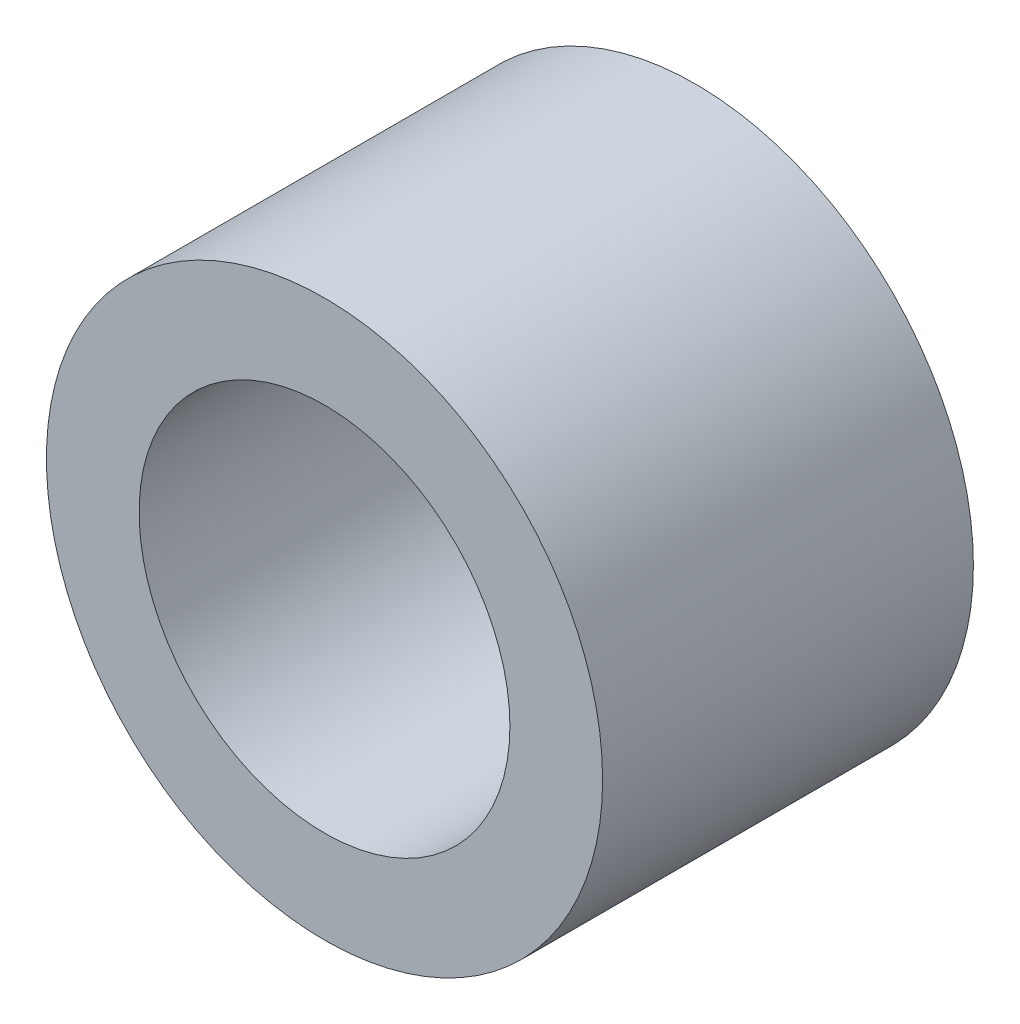
ISO-10303-21;
HEADER;
FILE_DESCRIPTION(('STEP AP214'),'2;1');
FILE_NAME('part.step','',(''),(''),'','','');
FILE_SCHEMA(('AUTOMOTIVE_DESIGN { 1 0 10303 214 1 1 1 1 }'));
ENDSEC;
DATA;
#1=APPLICATION_CONTEXT('core data for automotive mechanical design processes');
#2=APPLICATION_PROTOCOL_DEFINITION('international standard','automotive_design',2000,#1);
#3=PRODUCT_CONTEXT('',#1,'mechanical');
#4=PRODUCT('Part','Part','',(#3));
#5=PRODUCT_RELATED_PRODUCT_CATEGORY('part','',(#4));
#6=PRODUCT_DEFINITION_FORMATION('','',#4);
#7=PRODUCT_DEFINITION_CONTEXT('part definition',#1,'design');
#8=PRODUCT_DEFINITION('design','',#6,#7);
#9=PRODUCT_DEFINITION_SHAPE('','',#8);
#10=(LENGTH_UNIT() NAMED_UNIT(*) SI_UNIT(.MILLI.,.METRE.));
#11=(NAMED_UNIT(*) PLANE_ANGLE_UNIT() SI_UNIT($,.RADIAN.));
#12=(NAMED_UNIT(*) SI_UNIT($,.STERADIAN.) SOLID_ANGLE_UNIT());
#13=UNCERTAINTY_MEASURE_WITH_UNIT(LENGTH_MEASURE(1.E-05),#10,'distance_accuracy_value','');
#14=(GEOMETRIC_REPRESENTATION_CONTEXT(3) GLOBAL_UNCERTAINTY_ASSIGNED_CONTEXT((#13)) GLOBAL_UNIT_ASSIGNED_CONTEXT((#10,
#11,#12)) REPRESENTATION_CONTEXT('',''));
#15=CARTESIAN_POINT('',(0.,0.,0.));
#16=DIRECTION('',(0.,0.,1.));
#17=DIRECTION('',(1.,0.,0.));
#18=AXIS2_PLACEMENT_3D('',#15,#16,#17);
#19=CARTESIAN_POINT('',(0.,0.,3.175));
#20=DIRECTION('',(0.,0.,1.));
#21=DIRECTION('',(1.,0.,0.));
#22=AXIS2_PLACEMENT_3D('',#19,#20,#21);
#23=PLANE('',#22);
#24=CARTESIAN_POINT('',(0.,0.,3.175));
#25=DIRECTION('',(0.,0.,1.));
#26=DIRECTION('',(1.,0.,0.));
#27=AXIS2_PLACEMENT_3D('',#24,#25,#26);
#28=CIRCLE('',#27,4.7625);
#29=CARTESIAN_POINT('',(4.7625,0.,3.175));
#30=VERTEX_POINT('',#29);
#31=EDGE_CURVE('E10',#30,#30,#28,.T.);
#32=ORIENTED_EDGE('',*,*,#31,.T.);
#33=EDGE_LOOP('',(#32));
#34=FACE_BOUND('',#33,.T.);
#35=CARTESIAN_POINT('',(0.,0.,3.175));
#36=DIRECTION('',(0.,0.,1.));
#37=DIRECTION('',(1.,0.,0.));
#38=AXIS2_PLACEMENT_3D('',#35,#36,#37);
#39=CIRCLE('',#38,3.175);
#40=CARTESIAN_POINT('',(3.175,0.,3.175));
#41=VERTEX_POINT('',#40);
#42=EDGE_CURVE('E41',#41,#41,#39,.T.);
#43=ORIENTED_EDGE('',*,*,#42,.F.);
#44=EDGE_LOOP('',(#43));
#45=FACE_BOUND('',#44,.T.);
#46=ADVANCED_FACE('F30',(#34,#45),#23,.T.);
#47=CARTESIAN_POINT('',(0.,0.,-3.175));
#48=DIRECTION('',(0.,0.,1.));
#49=DIRECTION('',(1.,0.,0.));
#50=AXIS2_PLACEMENT_3D('',#47,#48,#49);
#51=PLANE('',#50);
#52=CARTESIAN_POINT('',(0.,0.,-3.175));
#53=DIRECTION('',(0.,0.,1.));
#54=DIRECTION('',(1.,0.,0.));
#55=AXIS2_PLACEMENT_3D('',#52,#53,#54);
#56=CIRCLE('',#55,4.7625);
#57=CARTESIAN_POINT('',(4.7625,0.,-3.175));
#58=VERTEX_POINT('',#57);
#59=EDGE_CURVE('E34',#58,#58,#56,.T.);
#60=ORIENTED_EDGE('',*,*,#59,.F.);
#61=EDGE_LOOP('',(#60));
#62=FACE_BOUND('',#61,.T.);
#63=CARTESIAN_POINT('',(0.,0.,-3.175));
#64=DIRECTION('',(0.,0.,1.));
#65=DIRECTION('',(1.,0.,0.));
#66=AXIS2_PLACEMENT_3D('',#63,#64,#65);
#67=CIRCLE('',#66,3.175);
#68=CARTESIAN_POINT('',(3.175,0.,-3.175));
#69=VERTEX_POINT('',#68);
#70=EDGE_CURVE('E43',#69,#69,#67,.T.);
#71=ORIENTED_EDGE('',*,*,#70,.T.);
#72=EDGE_LOOP('',(#71));
#73=FACE_BOUND('',#72,.T.);
#74=ADVANCED_FACE('F53',(#62,#73),#51,.F.);
#75=CARTESIAN_POINT('',(0.,0.,3.175));
#76=DIRECTION('',(0.,0.,-1.));
#77=DIRECTION('',(-1.,0.,0.));
#78=AXIS2_PLACEMENT_3D('',#75,#76,#77);
#79=CYLINDRICAL_SURFACE('',#78,4.7625);
#80=ORIENTED_EDGE('',*,*,#31,.F.);
#81=EDGE_LOOP('',(#80));
#82=FACE_BOUND('',#81,.T.);
#83=ORIENTED_EDGE('',*,*,#59,.T.);
#84=EDGE_LOOP('',(#83));
#85=FACE_BOUND('',#84,.T.);
#86=ADVANCED_FACE('F32',(#82,#85),#79,.T.);
#87=CARTESIAN_POINT('',(0.,0.,3.175));
#88=DIRECTION('',(0.,0.,-1.));
#89=DIRECTION('',(-1.,0.,0.));
#90=AXIS2_PLACEMENT_3D('',#87,#88,#89);
#91=CYLINDRICAL_SURFACE('',#90,3.175);
#92=ORIENTED_EDGE('',*,*,#42,.T.);
#93=EDGE_LOOP('',(#92));
#94=FACE_BOUND('',#93,.T.);
#95=ORIENTED_EDGE('',*,*,#70,.F.);
#96=EDGE_LOOP('',(#95));
#97=FACE_BOUND('',#96,.T.);
#98=ADVANCED_FACE('F49',(#94,#97),#91,.F.);
#99=CLOSED_SHELL('',(#46,#74,#86,#98));
#100=MANIFOLD_SOLID_BREP('B2',#99);
#101=ADVANCED_BREP_SHAPE_REPRESENTATION('',(#18,#100),#14);
#102=SHAPE_DEFINITION_REPRESENTATION(#9,#101);
ENDSEC;
END-ISO-10303-21;
